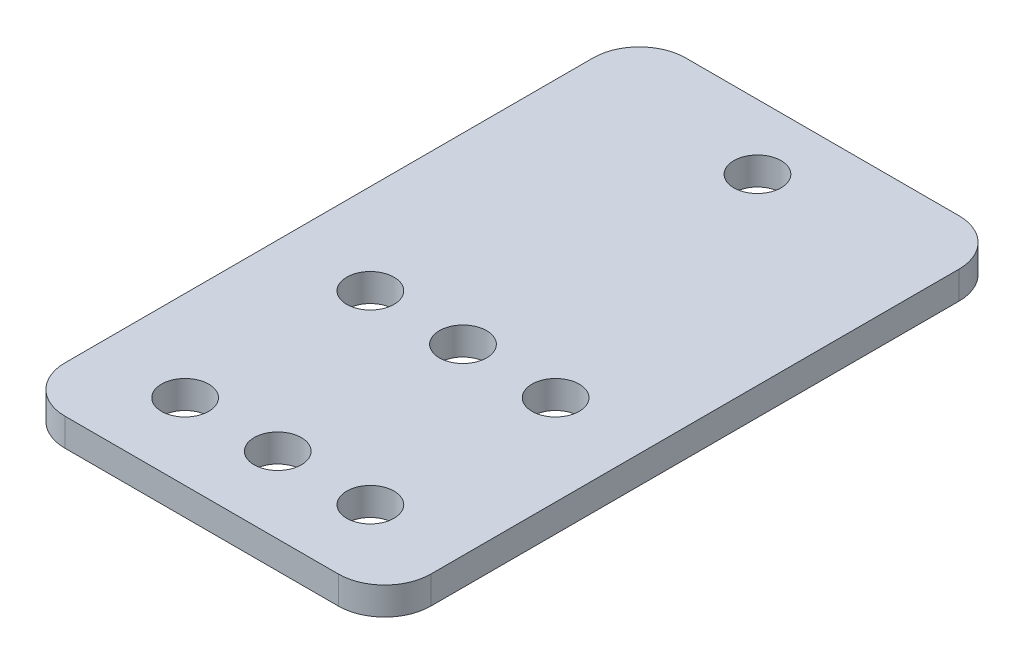
ISO-10303-21;
HEADER;
FILE_DESCRIPTION(('STEP AP214'),'2;1');
FILE_NAME('part.step','',(''),(''),'','','');
FILE_SCHEMA(('AUTOMOTIVE_DESIGN { 1 0 10303 214 1 1 1 1 }'));
ENDSEC;
DATA;
#1=APPLICATION_CONTEXT('core data for automotive mechanical design processes');
#2=APPLICATION_PROTOCOL_DEFINITION('international standard','automotive_design',2000,#1);
#3=PRODUCT_CONTEXT('',#1,'mechanical');
#4=PRODUCT('Part','Part','',(#3));
#5=PRODUCT_RELATED_PRODUCT_CATEGORY('part','',(#4));
#6=PRODUCT_DEFINITION_FORMATION('','',#4);
#7=PRODUCT_DEFINITION_CONTEXT('part definition',#1,'design');
#8=PRODUCT_DEFINITION('design','',#6,#7);
#9=PRODUCT_DEFINITION_SHAPE('','',#8);
#10=(LENGTH_UNIT() NAMED_UNIT(*) SI_UNIT(.MILLI.,.METRE.));
#11=(NAMED_UNIT(*) PLANE_ANGLE_UNIT() SI_UNIT($,.RADIAN.));
#12=(NAMED_UNIT(*) SI_UNIT($,.STERADIAN.) SOLID_ANGLE_UNIT());
#13=UNCERTAINTY_MEASURE_WITH_UNIT(LENGTH_MEASURE(1.E-05),#10,'distance_accuracy_value','');
#14=(GEOMETRIC_REPRESENTATION_CONTEXT(3) GLOBAL_UNCERTAINTY_ASSIGNED_CONTEXT((#13)) GLOBAL_UNIT_ASSIGNED_CONTEXT((#10,
#11,#12)) REPRESENTATION_CONTEXT('',''));
#15=CARTESIAN_POINT('',(0.,0.,0.));
#16=DIRECTION('',(0.,0.,1.));
#17=DIRECTION('',(1.,0.,0.));
#18=AXIS2_PLACEMENT_3D('',#15,#16,#17);
#19=CARTESIAN_POINT('',(-14.75,3.,28.5));
#20=DIRECTION('',(0.,-1.,0.));
#21=DIRECTION('',(0.,0.,-1.));
#22=AXIS2_PLACEMENT_3D('',#19,#20,#21);
#23=PLANE('',#22);
#24=CARTESIAN_POINT('',(-9.99999999999999,3.,25.29));
#25=DIRECTION('',(0.,1.,0.));
#26=DIRECTION('',(0.,0.,1.));
#27=AXIS2_PLACEMENT_3D('',#24,#25,#26);
#28=CIRCLE('',#27,2.55);
#29=CARTESIAN_POINT('',(-9.99999999999999,3.,27.84));
#30=VERTEX_POINT('',#29);
#31=EDGE_CURVE('E208',#30,#30,#28,.T.);
#32=ORIENTED_EDGE('',*,*,#31,.F.);
#33=EDGE_LOOP('',(#32));
#34=FACE_BOUND('',#33,.T.);
#35=CARTESIAN_POINT('',(0.,3.,25.29));
#36=DIRECTION('',(0.,1.,0.));
#37=DIRECTION('',(0.,0.,1.));
#38=AXIS2_PLACEMENT_3D('',#35,#36,#37);
#39=CIRCLE('',#38,2.55);
#40=CARTESIAN_POINT('',(0.,3.,27.84));
#41=VERTEX_POINT('',#40);
#42=EDGE_CURVE('E196',#41,#41,#39,.T.);
#43=ORIENTED_EDGE('',*,*,#42,.F.);
#44=EDGE_LOOP('',(#43));
#45=FACE_BOUND('',#44,.T.);
#46=CARTESIAN_POINT('',(10.,3.,25.29));
#47=DIRECTION('',(0.,1.,0.));
#48=DIRECTION('',(0.,0.,1.));
#49=AXIS2_PLACEMENT_3D('',#46,#47,#48);
#50=CIRCLE('',#49,2.55);
#51=CARTESIAN_POINT('',(10.,3.,27.84));
#52=VERTEX_POINT('',#51);
#53=EDGE_CURVE('E184',#52,#52,#50,.T.);
#54=ORIENTED_EDGE('',*,*,#53,.F.);
#55=EDGE_LOOP('',(#54));
#56=FACE_BOUND('',#55,.T.);
#57=CARTESIAN_POINT('',(-14.75,3.,28.5));
#58=DIRECTION('',(0.,1.,0.));
#59=DIRECTION('',(0.,0.,-1.));
#60=AXIS2_PLACEMENT_3D('',#57,#58,#59);
#61=CIRCLE('',#60,5.);
#62=CARTESIAN_POINT('',(-19.75,3.,28.5));
#63=VERTEX_POINT('',#62);
#64=CARTESIAN_POINT('',(-14.75,3.,33.5));
#65=VERTEX_POINT('',#64);
#66=EDGE_CURVE('E147',#63,#65,#61,.T.);
#67=ORIENTED_EDGE('',*,*,#66,.T.);
#68=DIRECTION('',(1.,0.,0.));
#69=VECTOR('',#68,1.);
#70=CARTESIAN_POINT('',(14.75,3.,33.5));
#71=LINE('',#70,#69);
#72=CARTESIAN_POINT('',(14.75,3.,33.5));
#73=VERTEX_POINT('',#72);
#74=EDGE_CURVE('E95',#65,#73,#71,.T.);
#75=ORIENTED_EDGE('',*,*,#74,.T.);
#76=CARTESIAN_POINT('',(14.75,3.,28.5));
#77=DIRECTION('',(0.,1.,0.));
#78=DIRECTION('',(0.,0.,1.));
#79=AXIS2_PLACEMENT_3D('',#76,#77,#78);
#80=CIRCLE('',#79,5.00000000000001);
#81=CARTESIAN_POINT('',(19.75,3.,28.5));
#82=VERTEX_POINT('',#81);
#83=EDGE_CURVE('E162',#73,#82,#80,.T.);
#84=ORIENTED_EDGE('',*,*,#83,.T.);
#85=DIRECTION('',(0.,0.,-1.));
#86=VECTOR('',#85,1.);
#87=CARTESIAN_POINT('',(19.75,3.,28.5));
#88=LINE('',#87,#86);
#89=CARTESIAN_POINT('',(19.75,3.,-28.5));
#90=VERTEX_POINT('',#89);
#91=EDGE_CURVE('E175',#82,#90,#88,.T.);
#92=ORIENTED_EDGE('',*,*,#91,.T.);
#93=CARTESIAN_POINT('',(14.75,3.,-28.5));
#94=DIRECTION('',(0.,1.,0.));
#95=DIRECTION('',(0.,0.,1.));
#96=AXIS2_PLACEMENT_3D('',#93,#94,#95);
#97=CIRCLE('',#96,5.);
#98=CARTESIAN_POINT('',(14.75,3.,-33.5));
#99=VERTEX_POINT('',#98);
#100=EDGE_CURVE('E114',#90,#99,#97,.T.);
#101=ORIENTED_EDGE('',*,*,#100,.T.);
#102=DIRECTION('',(-1.,0.,0.));
#103=VECTOR('',#102,1.);
#104=CARTESIAN_POINT('',(14.75,3.,-33.5));
#105=LINE('',#104,#103);
#106=CARTESIAN_POINT('',(-14.75,3.,-33.5));
#107=VERTEX_POINT('',#106);
#108=EDGE_CURVE('E108',#99,#107,#105,.T.);
#109=ORIENTED_EDGE('',*,*,#108,.T.);
#110=CARTESIAN_POINT('',(-14.75,3.,-28.5));
#111=DIRECTION('',(0.,1.,0.));
#112=DIRECTION('',(0.,0.,1.));
#113=AXIS2_PLACEMENT_3D('',#110,#111,#112);
#114=CIRCLE('',#113,5.);
#115=CARTESIAN_POINT('',(-19.75,3.,-28.5));
#116=VERTEX_POINT('',#115);
#117=EDGE_CURVE('E112',#107,#116,#114,.T.);
#118=ORIENTED_EDGE('',*,*,#117,.T.);
#119=DIRECTION('',(0.,0.,1.));
#120=VECTOR('',#119,1.);
#121=CARTESIAN_POINT('',(-19.75,3.,28.5));
#122=LINE('',#121,#120);
#123=EDGE_CURVE('E52',#116,#63,#122,.T.);
#124=ORIENTED_EDGE('',*,*,#123,.T.);
#125=EDGE_LOOP('',(#67,#75,#84,#92,#101,#109,#118,#124));
#126=FACE_BOUND('',#125,.T.);
#127=CARTESIAN_POINT('',(0.,3.,-26.5));
#128=DIRECTION('',(0.,1.,0.));
#129=DIRECTION('',(0.,0.,1.));
#130=AXIS2_PLACEMENT_3D('',#127,#128,#129);
#131=CIRCLE('',#130,2.55);
#132=CARTESIAN_POINT('',(0.,3.,-23.95));
#133=VERTEX_POINT('',#132);
#134=EDGE_CURVE('E136',#133,#133,#131,.T.);
#135=ORIENTED_EDGE('',*,*,#134,.F.);
#136=EDGE_LOOP('',(#135));
#137=FACE_BOUND('',#136,.T.);
#138=CARTESIAN_POINT('',(10.,3.,5.29));
#139=DIRECTION('',(0.,1.,0.));
#140=DIRECTION('',(0.,0.,1.));
#141=AXIS2_PLACEMENT_3D('',#138,#139,#140);
#142=CIRCLE('',#141,2.55);
#143=CARTESIAN_POINT('',(10.,3.,7.84));
#144=VERTEX_POINT('',#143);
#145=EDGE_CURVE('E190',#144,#144,#142,.T.);
#146=ORIENTED_EDGE('',*,*,#145,.F.);
#147=EDGE_LOOP('',(#146));
#148=FACE_BOUND('',#147,.T.);
#149=CARTESIAN_POINT('',(0.,3.,5.29));
#150=DIRECTION('',(0.,1.,0.));
#151=DIRECTION('',(0.,0.,1.));
#152=AXIS2_PLACEMENT_3D('',#149,#150,#151);
#153=CIRCLE('',#152,2.55);
#154=CARTESIAN_POINT('',(0.,3.,7.84));
#155=VERTEX_POINT('',#154);
#156=EDGE_CURVE('E202',#155,#155,#153,.T.);
#157=ORIENTED_EDGE('',*,*,#156,.F.);
#158=EDGE_LOOP('',(#157));
#159=FACE_BOUND('',#158,.T.);
#160=CARTESIAN_POINT('',(-9.99999999999999,3.,5.29));
#161=DIRECTION('',(0.,1.,0.));
#162=DIRECTION('',(0.,0.,1.));
#163=AXIS2_PLACEMENT_3D('',#160,#161,#162);
#164=CIRCLE('',#163,2.55);
#165=CARTESIAN_POINT('',(-9.99999999999999,3.,7.84));
#166=VERTEX_POINT('',#165);
#167=EDGE_CURVE('E214',#166,#166,#164,.T.);
#168=ORIENTED_EDGE('',*,*,#167,.F.);
#169=EDGE_LOOP('',(#168));
#170=FACE_BOUND('',#169,.T.);
#171=ADVANCED_FACE('F35',(#34,#45,#56,#126,#137,#148,#159,#170),#23,.F.);
#172=CARTESIAN_POINT('',(-14.75,0.,28.5));
#173=DIRECTION('',(0.,-1.,0.));
#174=DIRECTION('',(0.,0.,-1.));
#175=AXIS2_PLACEMENT_3D('',#172,#173,#174);
#176=PLANE('',#175);
#177=CARTESIAN_POINT('',(-9.99999999999999,0.,25.29));
#178=DIRECTION('',(0.,1.,0.));
#179=DIRECTION('',(0.,0.,1.));
#180=AXIS2_PLACEMENT_3D('',#177,#178,#179);
#181=CIRCLE('',#180,2.55);
#182=CARTESIAN_POINT('',(-9.99999999999999,0.,27.84));
#183=VERTEX_POINT('',#182);
#184=EDGE_CURVE('E211',#183,#183,#181,.T.);
#185=ORIENTED_EDGE('',*,*,#184,.T.);
#186=EDGE_LOOP('',(#185));
#187=FACE_BOUND('',#186,.T.);
#188=CARTESIAN_POINT('',(0.,0.,25.29));
#189=DIRECTION('',(0.,1.,0.));
#190=DIRECTION('',(0.,0.,1.));
#191=AXIS2_PLACEMENT_3D('',#188,#189,#190);
#192=CIRCLE('',#191,2.55);
#193=CARTESIAN_POINT('',(0.,0.,27.84));
#194=VERTEX_POINT('',#193);
#195=EDGE_CURVE('E199',#194,#194,#192,.T.);
#196=ORIENTED_EDGE('',*,*,#195,.T.);
#197=EDGE_LOOP('',(#196));
#198=FACE_BOUND('',#197,.T.);
#199=CARTESIAN_POINT('',(10.,0.,25.29));
#200=DIRECTION('',(0.,1.,0.));
#201=DIRECTION('',(0.,0.,1.));
#202=AXIS2_PLACEMENT_3D('',#199,#200,#201);
#203=CIRCLE('',#202,2.55);
#204=CARTESIAN_POINT('',(10.,0.,27.84));
#205=VERTEX_POINT('',#204);
#206=EDGE_CURVE('E187',#205,#205,#203,.T.);
#207=ORIENTED_EDGE('',*,*,#206,.T.);
#208=EDGE_LOOP('',(#207));
#209=FACE_BOUND('',#208,.T.);
#210=CARTESIAN_POINT('',(-14.75,0.,28.5));
#211=DIRECTION('',(0.,1.,0.));
#212=DIRECTION('',(0.,0.,-1.));
#213=AXIS2_PLACEMENT_3D('',#210,#211,#212);
#214=CIRCLE('',#213,5.);
#215=CARTESIAN_POINT('',(-19.75,0.,28.5));
#216=VERTEX_POINT('',#215);
#217=CARTESIAN_POINT('',(-14.75,0.,33.5));
#218=VERTEX_POINT('',#217);
#219=EDGE_CURVE('E132',#216,#218,#214,.T.);
#220=ORIENTED_EDGE('',*,*,#219,.F.);
#221=DIRECTION('',(0.,0.,1.));
#222=VECTOR('',#221,1.);
#223=CARTESIAN_POINT('',(-19.75,0.,28.5));
#224=LINE('',#223,#222);
#225=CARTESIAN_POINT('',(-19.75,0.,-28.5));
#226=VERTEX_POINT('',#225);
#227=EDGE_CURVE('E87',#226,#216,#224,.T.);
#228=ORIENTED_EDGE('',*,*,#227,.F.);
#229=CARTESIAN_POINT('',(-14.75,0.,-28.5));
#230=DIRECTION('',(0.,1.,0.));
#231=DIRECTION('',(0.,0.,1.));
#232=AXIS2_PLACEMENT_3D('',#229,#230,#231);
#233=CIRCLE('',#232,5.);
#234=CARTESIAN_POINT('',(-14.75,0.,-33.5));
#235=VERTEX_POINT('',#234);
#236=EDGE_CURVE('E81',#235,#226,#233,.T.);
#237=ORIENTED_EDGE('',*,*,#236,.F.);
#238=DIRECTION('',(-1.,0.,0.));
#239=VECTOR('',#238,1.);
#240=CARTESIAN_POINT('',(14.75,0.,-33.5));
#241=LINE('',#240,#239);
#242=CARTESIAN_POINT('',(14.75,0.,-33.5));
#243=VERTEX_POINT('',#242);
#244=EDGE_CURVE('E122',#243,#235,#241,.T.);
#245=ORIENTED_EDGE('',*,*,#244,.F.);
#246=CARTESIAN_POINT('',(14.75,0.,-28.5));
#247=DIRECTION('',(0.,1.,0.));
#248=DIRECTION('',(0.,0.,1.));
#249=AXIS2_PLACEMENT_3D('',#246,#247,#248);
#250=CIRCLE('',#249,5.);
#251=CARTESIAN_POINT('',(19.75,0.,-28.5));
#252=VERTEX_POINT('',#251);
#253=EDGE_CURVE('E142',#252,#243,#250,.T.);
#254=ORIENTED_EDGE('',*,*,#253,.F.);
#255=DIRECTION('',(0.,0.,-1.));
#256=VECTOR('',#255,1.);
#257=CARTESIAN_POINT('',(19.75,0.,28.5));
#258=LINE('',#257,#256);
#259=CARTESIAN_POINT('',(19.75,0.,28.5));
#260=VERTEX_POINT('',#259);
#261=EDGE_CURVE('E140',#260,#252,#258,.T.);
#262=ORIENTED_EDGE('',*,*,#261,.F.);
#263=CARTESIAN_POINT('',(14.75,0.,28.5));
#264=DIRECTION('',(0.,1.,0.));
#265=DIRECTION('',(0.,0.,1.));
#266=AXIS2_PLACEMENT_3D('',#263,#264,#265);
#267=CIRCLE('',#266,5.00000000000001);
#268=CARTESIAN_POINT('',(14.75,0.,33.5));
#269=VERTEX_POINT('',#268);
#270=EDGE_CURVE('E138',#269,#260,#267,.T.);
#271=ORIENTED_EDGE('',*,*,#270,.F.);
#272=DIRECTION('',(1.,0.,0.));
#273=VECTOR('',#272,1.);
#274=CARTESIAN_POINT('',(14.75,0.,33.5));
#275=LINE('',#274,#273);
#276=EDGE_CURVE('E135',#218,#269,#275,.T.);
#277=ORIENTED_EDGE('',*,*,#276,.F.);
#278=EDGE_LOOP('',(#220,#228,#237,#245,#254,#262,#271,#277));
#279=FACE_BOUND('',#278,.T.);
#280=CARTESIAN_POINT('',(0.,0.,-26.5));
#281=DIRECTION('',(0.,1.,0.));
#282=DIRECTION('',(0.,0.,1.));
#283=AXIS2_PLACEMENT_3D('',#280,#281,#282);
#284=CIRCLE('',#283,2.55);
#285=CARTESIAN_POINT('',(0.,0.,-23.95));
#286=VERTEX_POINT('',#285);
#287=EDGE_CURVE('E181',#286,#286,#284,.T.);
#288=ORIENTED_EDGE('',*,*,#287,.T.);
#289=EDGE_LOOP('',(#288));
#290=FACE_BOUND('',#289,.T.);
#291=CARTESIAN_POINT('',(10.,0.,5.29));
#292=DIRECTION('',(0.,1.,0.));
#293=DIRECTION('',(0.,0.,1.));
#294=AXIS2_PLACEMENT_3D('',#291,#292,#293);
#295=CIRCLE('',#294,2.55);
#296=CARTESIAN_POINT('',(10.,0.,7.84));
#297=VERTEX_POINT('',#296);
#298=EDGE_CURVE('E193',#297,#297,#295,.T.);
#299=ORIENTED_EDGE('',*,*,#298,.T.);
#300=EDGE_LOOP('',(#299));
#301=FACE_BOUND('',#300,.T.);
#302=CARTESIAN_POINT('',(0.,0.,5.29));
#303=DIRECTION('',(0.,1.,0.));
#304=DIRECTION('',(0.,0.,1.));
#305=AXIS2_PLACEMENT_3D('',#302,#303,#304);
#306=CIRCLE('',#305,2.55);
#307=CARTESIAN_POINT('',(0.,0.,7.84));
#308=VERTEX_POINT('',#307);
#309=EDGE_CURVE('E205',#308,#308,#306,.T.);
#310=ORIENTED_EDGE('',*,*,#309,.T.);
#311=EDGE_LOOP('',(#310));
#312=FACE_BOUND('',#311,.T.);
#313=CARTESIAN_POINT('',(-9.99999999999999,0.,5.29));
#314=DIRECTION('',(0.,1.,0.));
#315=DIRECTION('',(0.,0.,1.));
#316=AXIS2_PLACEMENT_3D('',#313,#314,#315);
#317=CIRCLE('',#316,2.55);
#318=CARTESIAN_POINT('',(-9.99999999999999,0.,7.84));
#319=VERTEX_POINT('',#318);
#320=EDGE_CURVE('E217',#319,#319,#317,.T.);
#321=ORIENTED_EDGE('',*,*,#320,.T.);
#322=EDGE_LOOP('',(#321));
#323=FACE_BOUND('',#322,.T.);
#324=ADVANCED_FACE('F166',(#187,#198,#209,#279,#290,#301,#312,#323),#176,.T.);
#325=CARTESIAN_POINT('',(-14.75,3.,28.5));
#326=DIRECTION('',(0.,-1.,0.));
#327=DIRECTION('',(0.,0.,-1.));
#328=AXIS2_PLACEMENT_3D('',#325,#326,#327);
#329=CYLINDRICAL_SURFACE('',#328,5.);
#330=ORIENTED_EDGE('',*,*,#219,.T.);
#331=DIRECTION('',(0.,-1.,0.));
#332=VECTOR('',#331,1.);
#333=CARTESIAN_POINT('',(-14.75,3.,33.5));
#334=LINE('',#333,#332);
#335=EDGE_CURVE('E11',#65,#218,#334,.T.);
#336=ORIENTED_EDGE('',*,*,#335,.F.);
#337=ORIENTED_EDGE('',*,*,#66,.F.);
#338=DIRECTION('',(0.,-1.,0.));
#339=VECTOR('',#338,1.);
#340=CARTESIAN_POINT('',(-19.75,3.,28.5));
#341=LINE('',#340,#339);
#342=EDGE_CURVE('E128',#63,#216,#341,.T.);
#343=ORIENTED_EDGE('',*,*,#342,.T.);
#344=EDGE_LOOP('',(#330,#336,#337,#343));
#345=FACE_BOUND('',#344,.T.);
#346=ADVANCED_FACE('F37',(#345),#329,.T.);
#347=CARTESIAN_POINT('',(14.75,3.,33.5));
#348=DIRECTION('',(0.,0.,-1.));
#349=DIRECTION('',(-1.,0.,0.));
#350=AXIS2_PLACEMENT_3D('',#347,#348,#349);
#351=PLANE('',#350);
#352=ORIENTED_EDGE('',*,*,#276,.T.);
#353=DIRECTION('',(0.,-1.,0.));
#354=VECTOR('',#353,1.);
#355=CARTESIAN_POINT('',(14.75,3.,33.5));
#356=LINE('',#355,#354);
#357=EDGE_CURVE('E44',#73,#269,#356,.T.);
#358=ORIENTED_EDGE('',*,*,#357,.F.);
#359=ORIENTED_EDGE('',*,*,#74,.F.);
#360=ORIENTED_EDGE('',*,*,#335,.T.);
#361=EDGE_LOOP('',(#352,#358,#359,#360));
#362=FACE_BOUND('',#361,.T.);
#363=ADVANCED_FACE('F252',(#362),#351,.F.);
#364=CARTESIAN_POINT('',(14.75,3.,28.5));
#365=DIRECTION('',(0.,-1.,0.));
#366=DIRECTION('',(0.,0.,-1.));
#367=AXIS2_PLACEMENT_3D('',#364,#365,#366);
#368=CYLINDRICAL_SURFACE('',#367,5.00000000000001);
#369=ORIENTED_EDGE('',*,*,#270,.T.);
#370=DIRECTION('',(0.,-1.,0.));
#371=VECTOR('',#370,1.);
#372=CARTESIAN_POINT('',(19.75,3.,28.5));
#373=LINE('',#372,#371);
#374=EDGE_CURVE('E154',#82,#260,#373,.T.);
#375=ORIENTED_EDGE('',*,*,#374,.F.);
#376=ORIENTED_EDGE('',*,*,#83,.F.);
#377=ORIENTED_EDGE('',*,*,#357,.T.);
#378=EDGE_LOOP('',(#369,#375,#376,#377));
#379=FACE_BOUND('',#378,.T.);
#380=ADVANCED_FACE('F160',(#379),#368,.T.);
#381=CARTESIAN_POINT('',(19.75,3.,28.5));
#382=DIRECTION('',(-1.,0.,0.));
#383=DIRECTION('',(0.,0.,1.));
#384=AXIS2_PLACEMENT_3D('',#381,#382,#383);
#385=PLANE('',#384);
#386=ORIENTED_EDGE('',*,*,#261,.T.);
#387=DIRECTION('',(0.,-1.,0.));
#388=VECTOR('',#387,1.);
#389=CARTESIAN_POINT('',(19.75,3.,-28.5));
#390=LINE('',#389,#388);
#391=EDGE_CURVE('E151',#90,#252,#390,.T.);
#392=ORIENTED_EDGE('',*,*,#391,.F.);
#393=ORIENTED_EDGE('',*,*,#91,.F.);
#394=ORIENTED_EDGE('',*,*,#374,.T.);
#395=EDGE_LOOP('',(#386,#392,#393,#394));
#396=FACE_BOUND('',#395,.T.);
#397=ADVANCED_FACE('F171',(#396),#385,.F.);
#398=CARTESIAN_POINT('',(14.75,3.,-28.5));
#399=DIRECTION('',(0.,-1.,0.));
#400=DIRECTION('',(0.,0.,-1.));
#401=AXIS2_PLACEMENT_3D('',#398,#399,#400);
#402=CYLINDRICAL_SURFACE('',#401,5.);
#403=ORIENTED_EDGE('',*,*,#253,.T.);
#404=DIRECTION('',(0.,-1.,0.));
#405=VECTOR('',#404,1.);
#406=CARTESIAN_POINT('',(14.75,3.,-33.5));
#407=LINE('',#406,#405);
#408=EDGE_CURVE('E123',#99,#243,#407,.T.);
#409=ORIENTED_EDGE('',*,*,#408,.F.);
#410=ORIENTED_EDGE('',*,*,#100,.F.);
#411=ORIENTED_EDGE('',*,*,#391,.T.);
#412=EDGE_LOOP('',(#403,#409,#410,#411));
#413=FACE_BOUND('',#412,.T.);
#414=ADVANCED_FACE('F174',(#413),#402,.T.);
#415=CARTESIAN_POINT('',(14.75,3.,-33.5));
#416=DIRECTION('',(0.,0.,1.));
#417=DIRECTION('',(1.,0.,0.));
#418=AXIS2_PLACEMENT_3D('',#415,#416,#417);
#419=PLANE('',#418);
#420=ORIENTED_EDGE('',*,*,#244,.T.);
#421=DIRECTION('',(0.,-1.,0.));
#422=VECTOR('',#421,1.);
#423=CARTESIAN_POINT('',(-14.75,3.,-33.5));
#424=LINE('',#423,#422);
#425=EDGE_CURVE('E119',#107,#235,#424,.T.);
#426=ORIENTED_EDGE('',*,*,#425,.F.);
#427=ORIENTED_EDGE('',*,*,#108,.F.);
#428=ORIENTED_EDGE('',*,*,#408,.T.);
#429=EDGE_LOOP('',(#420,#426,#427,#428));
#430=FACE_BOUND('',#429,.T.);
#431=ADVANCED_FACE('F120',(#430),#419,.F.);
#432=CARTESIAN_POINT('',(-14.75,3.,-28.5));
#433=DIRECTION('',(0.,-1.,0.));
#434=DIRECTION('',(0.,0.,-1.));
#435=AXIS2_PLACEMENT_3D('',#432,#433,#434);
#436=CYLINDRICAL_SURFACE('',#435,5.);
#437=ORIENTED_EDGE('',*,*,#236,.T.);
#438=DIRECTION('',(0.,-1.,0.));
#439=VECTOR('',#438,1.);
#440=CARTESIAN_POINT('',(-19.75,3.,-28.5));
#441=LINE('',#440,#439);
#442=EDGE_CURVE('E124',#116,#226,#441,.T.);
#443=ORIENTED_EDGE('',*,*,#442,.F.);
#444=ORIENTED_EDGE('',*,*,#117,.F.);
#445=ORIENTED_EDGE('',*,*,#425,.T.);
#446=EDGE_LOOP('',(#437,#443,#444,#445));
#447=FACE_BOUND('',#446,.T.);
#448=ADVANCED_FACE('F126',(#447),#436,.T.);
#449=CARTESIAN_POINT('',(-19.75,3.,28.5));
#450=DIRECTION('',(1.,0.,0.));
#451=DIRECTION('',(0.,0.,-1.));
#452=AXIS2_PLACEMENT_3D('',#449,#450,#451);
#453=PLANE('',#452);
#454=ORIENTED_EDGE('',*,*,#227,.T.);
#455=ORIENTED_EDGE('',*,*,#342,.F.);
#456=ORIENTED_EDGE('',*,*,#123,.F.);
#457=ORIENTED_EDGE('',*,*,#442,.T.);
#458=EDGE_LOOP('',(#454,#455,#456,#457));
#459=FACE_BOUND('',#458,.T.);
#460=ADVANCED_FACE('F240',(#459),#453,.F.);
#461=CARTESIAN_POINT('',(0.,3.,-26.5));
#462=DIRECTION('',(0.,-1.,0.));
#463=DIRECTION('',(0.,0.,-1.));
#464=AXIS2_PLACEMENT_3D('',#461,#462,#463);
#465=CYLINDRICAL_SURFACE('',#464,2.55);
#466=ORIENTED_EDGE('',*,*,#134,.T.);
#467=EDGE_LOOP('',(#466));
#468=FACE_BOUND('',#467,.T.);
#469=ORIENTED_EDGE('',*,*,#287,.F.);
#470=EDGE_LOOP('',(#469));
#471=FACE_BOUND('',#470,.T.);
#472=ADVANCED_FACE('F237',(#468,#471),#465,.F.);
#473=CARTESIAN_POINT('',(10.,3.,25.29));
#474=DIRECTION('',(0.,-1.,0.));
#475=DIRECTION('',(0.,0.,-1.));
#476=AXIS2_PLACEMENT_3D('',#473,#474,#475);
#477=CYLINDRICAL_SURFACE('',#476,2.55);
#478=ORIENTED_EDGE('',*,*,#53,.T.);
#479=EDGE_LOOP('',(#478));
#480=FACE_BOUND('',#479,.T.);
#481=ORIENTED_EDGE('',*,*,#206,.F.);
#482=EDGE_LOOP('',(#481));
#483=FACE_BOUND('',#482,.T.);
#484=ADVANCED_FACE('F316',(#480,#483),#477,.F.);
#485=CARTESIAN_POINT('',(10.,3.,5.29));
#486=DIRECTION('',(0.,-1.,0.));
#487=DIRECTION('',(0.,0.,-1.));
#488=AXIS2_PLACEMENT_3D('',#485,#486,#487);
#489=CYLINDRICAL_SURFACE('',#488,2.55);
#490=ORIENTED_EDGE('',*,*,#145,.T.);
#491=EDGE_LOOP('',(#490));
#492=FACE_BOUND('',#491,.T.);
#493=ORIENTED_EDGE('',*,*,#298,.F.);
#494=EDGE_LOOP('',(#493));
#495=FACE_BOUND('',#494,.T.);
#496=ADVANCED_FACE('F324',(#492,#495),#489,.F.);
#497=CARTESIAN_POINT('',(0.,3.,25.29));
#498=DIRECTION('',(0.,-1.,0.));
#499=DIRECTION('',(0.,0.,-1.));
#500=AXIS2_PLACEMENT_3D('',#497,#498,#499);
#501=CYLINDRICAL_SURFACE('',#500,2.55);
#502=ORIENTED_EDGE('',*,*,#42,.T.);
#503=EDGE_LOOP('',(#502));
#504=FACE_BOUND('',#503,.T.);
#505=ORIENTED_EDGE('',*,*,#195,.F.);
#506=EDGE_LOOP('',(#505));
#507=FACE_BOUND('',#506,.T.);
#508=ADVANCED_FACE('F332',(#504,#507),#501,.F.);
#509=CARTESIAN_POINT('',(0.,3.,5.29));
#510=DIRECTION('',(0.,-1.,0.));
#511=DIRECTION('',(0.,0.,-1.));
#512=AXIS2_PLACEMENT_3D('',#509,#510,#511);
#513=CYLINDRICAL_SURFACE('',#512,2.55);
#514=ORIENTED_EDGE('',*,*,#156,.T.);
#515=EDGE_LOOP('',(#514));
#516=FACE_BOUND('',#515,.T.);
#517=ORIENTED_EDGE('',*,*,#309,.F.);
#518=EDGE_LOOP('',(#517));
#519=FACE_BOUND('',#518,.T.);
#520=ADVANCED_FACE('F341',(#516,#519),#513,.F.);
#521=CARTESIAN_POINT('',(-9.99999999999999,3.,25.29));
#522=DIRECTION('',(0.,-1.,0.));
#523=DIRECTION('',(0.,0.,-1.));
#524=AXIS2_PLACEMENT_3D('',#521,#522,#523);
#525=CYLINDRICAL_SURFACE('',#524,2.55);
#526=ORIENTED_EDGE('',*,*,#31,.T.);
#527=EDGE_LOOP('',(#526));
#528=FACE_BOUND('',#527,.T.);
#529=ORIENTED_EDGE('',*,*,#184,.F.);
#530=EDGE_LOOP('',(#529));
#531=FACE_BOUND('',#530,.T.);
#532=ADVANCED_FACE('F350',(#528,#531),#525,.F.);
#533=CARTESIAN_POINT('',(-9.99999999999999,3.,5.29));
#534=DIRECTION('',(0.,-1.,0.));
#535=DIRECTION('',(0.,0.,-1.));
#536=AXIS2_PLACEMENT_3D('',#533,#534,#535);
#537=CYLINDRICAL_SURFACE('',#536,2.55);
#538=ORIENTED_EDGE('',*,*,#167,.T.);
#539=EDGE_LOOP('',(#538));
#540=FACE_BOUND('',#539,.T.);
#541=ORIENTED_EDGE('',*,*,#320,.F.);
#542=EDGE_LOOP('',(#541));
#543=FACE_BOUND('',#542,.T.);
#544=ADVANCED_FACE('F223',(#540,#543),#537,.F.);
#545=CLOSED_SHELL('',(#171,#324,#346,#363,#380,#397,#414,#431,#448,#460,#472,#484,#496,#508,
#520,#532,#544));
#546=MANIFOLD_SOLID_BREP('B2',#545);
#547=ADVANCED_BREP_SHAPE_REPRESENTATION('',(#18,#546),#14);
#548=SHAPE_DEFINITION_REPRESENTATION(#9,#547);
ENDSEC;
END-ISO-10303-21;
